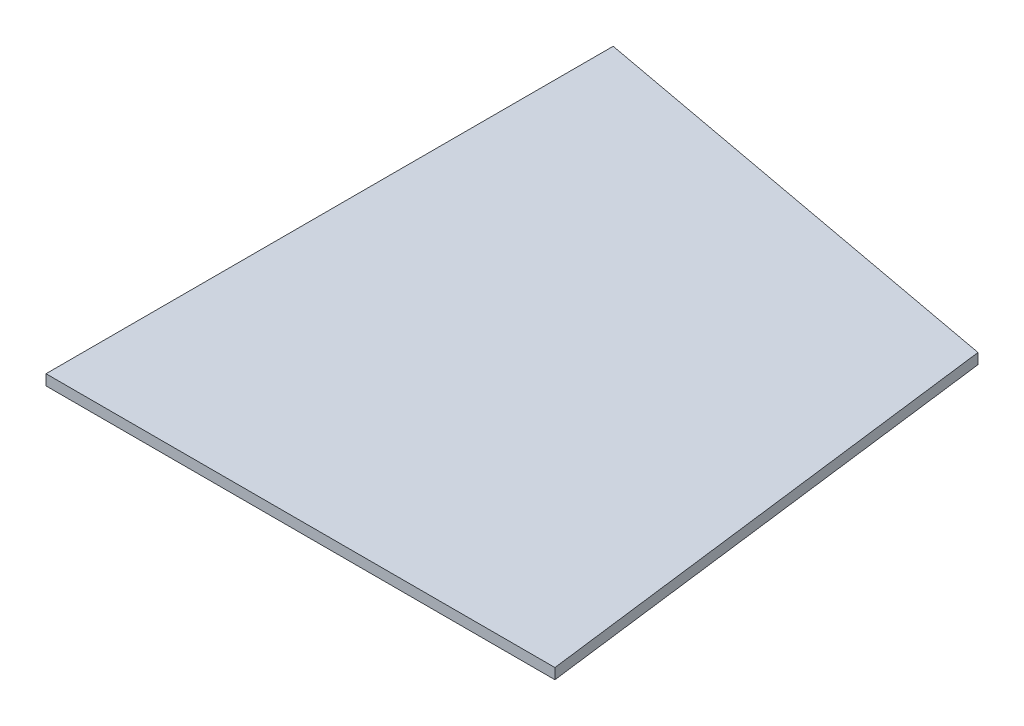
ISO-10303-21;
HEADER;
FILE_DESCRIPTION(('STEP AP214'),'2;1');
FILE_NAME('part.step','',(''),(''),'','','');
FILE_SCHEMA(('AUTOMOTIVE_DESIGN { 1 0 10303 214 1 1 1 1 }'));
ENDSEC;
DATA;
#1=APPLICATION_CONTEXT('core data for automotive mechanical design processes');
#2=APPLICATION_PROTOCOL_DEFINITION('international standard','automotive_design',2000,#1);
#3=PRODUCT_CONTEXT('',#1,'mechanical');
#4=PRODUCT('Part','Part','',(#3));
#5=PRODUCT_RELATED_PRODUCT_CATEGORY('part','',(#4));
#6=PRODUCT_DEFINITION_FORMATION('','',#4);
#7=PRODUCT_DEFINITION_CONTEXT('part definition',#1,'design');
#8=PRODUCT_DEFINITION('design','',#6,#7);
#9=PRODUCT_DEFINITION_SHAPE('','',#8);
#10=(LENGTH_UNIT() NAMED_UNIT(*) SI_UNIT(.MILLI.,.METRE.));
#11=(NAMED_UNIT(*) PLANE_ANGLE_UNIT() SI_UNIT($,.RADIAN.));
#12=(NAMED_UNIT(*) SI_UNIT($,.STERADIAN.) SOLID_ANGLE_UNIT());
#13=UNCERTAINTY_MEASURE_WITH_UNIT(LENGTH_MEASURE(1.E-05),#10,'distance_accuracy_value','');
#14=(GEOMETRIC_REPRESENTATION_CONTEXT(3) GLOBAL_UNCERTAINTY_ASSIGNED_CONTEXT((#13)) GLOBAL_UNIT_ASSIGNED_CONTEXT((#10,
#11,#12)) REPRESENTATION_CONTEXT('',''));
#15=CARTESIAN_POINT('',(0.,0.,0.));
#16=DIRECTION('',(0.,0.,1.));
#17=DIRECTION('',(1.,0.,0.));
#18=AXIS2_PLACEMENT_3D('',#15,#16,#17);
#19=CARTESIAN_POINT('',(0.,5.4737,0.));
#20=DIRECTION('',(-1.,0.,0.));
#21=DIRECTION('',(0.,0.,1.));
#22=AXIS2_PLACEMENT_3D('',#19,#20,#21);
#23=PLANE('',#22);
#24=DIRECTION('',(0.,0.,-1.));
#25=VECTOR('',#24,1.);
#26=CARTESIAN_POINT('',(0.,0.,0.));
#27=LINE('',#26,#25);
#28=CARTESIAN_POINT('',(0.,0.,0.));
#29=VERTEX_POINT('',#28);
#30=CARTESIAN_POINT('',(0.,0.,-293.6875));
#31=VERTEX_POINT('',#30);
#32=EDGE_CURVE('E97',#29,#31,#27,.T.);
#33=ORIENTED_EDGE('',*,*,#32,.F.);
#34=DIRECTION('',(0.,-1.,0.));
#35=VECTOR('',#34,1.);
#36=CARTESIAN_POINT('',(0.,5.4737,0.));
#37=LINE('',#36,#35);
#38=CARTESIAN_POINT('',(0.,5.4737,0.));
#39=VERTEX_POINT('',#38);
#40=EDGE_CURVE('E11',#39,#29,#37,.T.);
#41=ORIENTED_EDGE('',*,*,#40,.F.);
#42=DIRECTION('',(0.,0.,-1.));
#43=VECTOR('',#42,1.);
#44=CARTESIAN_POINT('',(0.,5.4737,0.));
#45=LINE('',#44,#43);
#46=CARTESIAN_POINT('',(0.,5.4737,-293.6875));
#47=VERTEX_POINT('',#46);
#48=EDGE_CURVE('E91',#39,#47,#45,.T.);
#49=ORIENTED_EDGE('',*,*,#48,.T.);
#50=DIRECTION('',(0.,-1.,0.));
#51=VECTOR('',#50,1.);
#52=CARTESIAN_POINT('',(0.,5.4737,-293.6875));
#53=LINE('',#52,#51);
#54=EDGE_CURVE('E35',#47,#31,#53,.T.);
#55=ORIENTED_EDGE('',*,*,#54,.T.);
#56=EDGE_LOOP('',(#33,#41,#49,#55));
#57=FACE_BOUND('',#56,.T.);
#58=ADVANCED_FACE('F32',(#57),#23,.T.);
#59=CARTESIAN_POINT('',(0.,5.4737,0.));
#60=DIRECTION('',(0.,0.,-1.));
#61=DIRECTION('',(-1.,0.,0.));
#62=AXIS2_PLACEMENT_3D('',#59,#60,#61);
#63=PLANE('',#62);
#64=DIRECTION('',(1.,0.,0.));
#65=VECTOR('',#64,1.);
#66=CARTESIAN_POINT('',(0.,0.,0.));
#67=LINE('',#66,#65);
#68=CARTESIAN_POINT('',(263.525,0.,0.));
#69=VERTEX_POINT('',#68);
#70=EDGE_CURVE('E93',#29,#69,#67,.T.);
#71=ORIENTED_EDGE('',*,*,#70,.T.);
#72=DIRECTION('',(0.,-1.,0.));
#73=VECTOR('',#72,1.);
#74=CARTESIAN_POINT('',(263.525,5.4737,0.));
#75=LINE('',#74,#73);
#76=CARTESIAN_POINT('',(263.525,5.4737,0.));
#77=VERTEX_POINT('',#76);
#78=EDGE_CURVE('E41',#77,#69,#75,.T.);
#79=ORIENTED_EDGE('',*,*,#78,.F.);
#80=DIRECTION('',(1.,0.,0.));
#81=VECTOR('',#80,1.);
#82=CARTESIAN_POINT('',(0.,5.4737,0.));
#83=LINE('',#82,#81);
#84=EDGE_CURVE('E88',#39,#77,#83,.T.);
#85=ORIENTED_EDGE('',*,*,#84,.F.);
#86=ORIENTED_EDGE('',*,*,#40,.T.);
#87=EDGE_LOOP('',(#71,#79,#85,#86));
#88=FACE_BOUND('',#87,.T.);
#89=ADVANCED_FACE('F104',(#88),#63,.F.);
#90=CARTESIAN_POINT('',(231.775,5.4737,-250.825));
#91=DIRECTION('',(0.992083472687499,0.,-0.125580186416139));
#92=DIRECTION('',(-0.125580186416139,0.,-0.992083472687499));
#93=AXIS2_PLACEMENT_3D('',#90,#91,#92);
#94=PLANE('',#93);
#95=DIRECTION('',(0.125580186416139,0.,0.992083472687499));
#96=VECTOR('',#95,1.);
#97=CARTESIAN_POINT('',(231.775,0.,-250.825));
#98=LINE('',#97,#96);
#99=CARTESIAN_POINT('',(231.775,0.,-250.825));
#100=VERTEX_POINT('',#99);
#101=EDGE_CURVE('E82',#100,#69,#98,.T.);
#102=ORIENTED_EDGE('',*,*,#101,.F.);
#103=DIRECTION('',(0.,-1.,0.));
#104=VECTOR('',#103,1.);
#105=CARTESIAN_POINT('',(231.775,5.4737,-250.825));
#106=LINE('',#105,#104);
#107=CARTESIAN_POINT('',(231.775,5.4737,-250.825));
#108=VERTEX_POINT('',#107);
#109=EDGE_CURVE('E77',#108,#100,#106,.T.);
#110=ORIENTED_EDGE('',*,*,#109,.F.);
#111=DIRECTION('',(0.125580186416139,0.,0.992083472687499));
#112=VECTOR('',#111,1.);
#113=CARTESIAN_POINT('',(231.775,5.4737,-250.825));
#114=LINE('',#113,#112);
#115=EDGE_CURVE('E80',#108,#77,#114,.T.);
#116=ORIENTED_EDGE('',*,*,#115,.T.);
#117=ORIENTED_EDGE('',*,*,#78,.T.);
#118=EDGE_LOOP('',(#102,#110,#116,#117));
#119=FACE_BOUND('',#118,.T.);
#120=ADVANCED_FACE('F79',(#119),#94,.T.);
#121=CARTESIAN_POINT('',(0.,5.4737,-293.6875));
#122=DIRECTION('',(0.181848076884126,0.,-0.983326637966014));
#123=DIRECTION('',(-0.983326637966014,0.,-0.181848076884126));
#124=AXIS2_PLACEMENT_3D('',#121,#122,#123);
#125=PLANE('',#124);
#126=DIRECTION('',(0.983326637966014,0.,0.181848076884126));
#127=VECTOR('',#126,1.);
#128=CARTESIAN_POINT('',(0.,0.,-293.6875));
#129=LINE('',#128,#127);
#130=EDGE_CURVE('E100',#31,#100,#129,.T.);
#131=ORIENTED_EDGE('',*,*,#130,.F.);
#132=ORIENTED_EDGE('',*,*,#54,.F.);
#133=DIRECTION('',(0.983326637966014,0.,0.181848076884126));
#134=VECTOR('',#133,1.);
#135=CARTESIAN_POINT('',(0.,5.4737,-293.6875));
#136=LINE('',#135,#134);
#137=EDGE_CURVE('E87',#47,#108,#136,.T.);
#138=ORIENTED_EDGE('',*,*,#137,.T.);
#139=ORIENTED_EDGE('',*,*,#109,.T.);
#140=EDGE_LOOP('',(#131,#132,#138,#139));
#141=FACE_BOUND('',#140,.T.);
#142=ADVANCED_FACE('F90',(#141),#125,.T.);
#143=CARTESIAN_POINT('',(0.,5.4737,0.));
#144=DIRECTION('',(0.,-1.,0.));
#145=DIRECTION('',(0.,0.,-1.));
#146=AXIS2_PLACEMENT_3D('',#143,#144,#145);
#147=PLANE('',#146);
#148=ORIENTED_EDGE('',*,*,#48,.F.);
#149=ORIENTED_EDGE('',*,*,#84,.T.);
#150=ORIENTED_EDGE('',*,*,#115,.F.);
#151=ORIENTED_EDGE('',*,*,#137,.F.);
#152=EDGE_LOOP('',(#148,#149,#150,#151));
#153=FACE_BOUND('',#152,.T.);
#154=ADVANCED_FACE('F86',(#153),#147,.F.);
#155=CARTESIAN_POINT('',(0.,0.,0.));
#156=DIRECTION('',(0.,-1.,0.));
#157=DIRECTION('',(0.,0.,-1.));
#158=AXIS2_PLACEMENT_3D('',#155,#156,#157);
#159=PLANE('',#158);
#160=ORIENTED_EDGE('',*,*,#32,.T.);
#161=ORIENTED_EDGE('',*,*,#130,.T.);
#162=ORIENTED_EDGE('',*,*,#101,.T.);
#163=ORIENTED_EDGE('',*,*,#70,.F.);
#164=EDGE_LOOP('',(#160,#161,#162,#163));
#165=FACE_BOUND('',#164,.T.);
#166=ADVANCED_FACE('F106',(#165),#159,.T.);
#167=CLOSED_SHELL('',(#58,#89,#120,#142,#154,#166));
#168=MANIFOLD_SOLID_BREP('B2',#167);
#169=ADVANCED_BREP_SHAPE_REPRESENTATION('',(#18,#168),#14);
#170=SHAPE_DEFINITION_REPRESENTATION(#9,#169);
ENDSEC;
END-ISO-10303-21;
